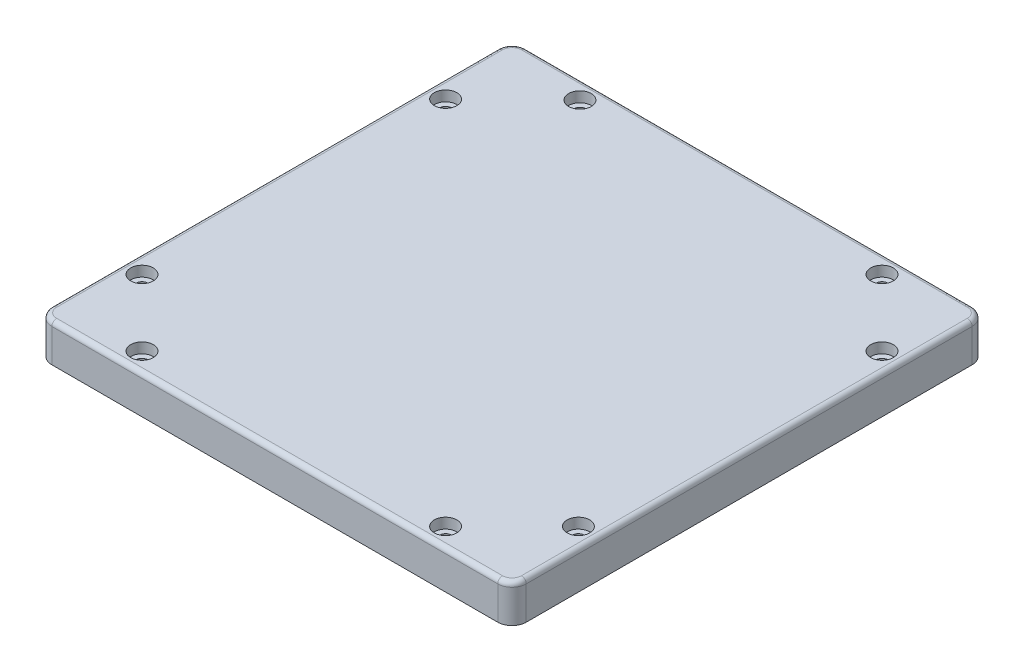
ISO-10303-21;
HEADER;
FILE_DESCRIPTION(('STEP AP214'),'2;1');
FILE_NAME('part.step','',(''),(''),'','','');
FILE_SCHEMA(('AUTOMOTIVE_DESIGN { 1 0 10303 214 1 1 1 1 }'));
ENDSEC;
DATA;
#1=APPLICATION_CONTEXT('core data for automotive mechanical design processes');
#2=APPLICATION_PROTOCOL_DEFINITION('international standard','automotive_design',2000,#1);
#3=PRODUCT_CONTEXT('',#1,'mechanical');
#4=PRODUCT('Part','Part','',(#3));
#5=PRODUCT_RELATED_PRODUCT_CATEGORY('part','',(#4));
#6=PRODUCT_DEFINITION_FORMATION('','',#4);
#7=PRODUCT_DEFINITION_CONTEXT('part definition',#1,'design');
#8=PRODUCT_DEFINITION('design','',#6,#7);
#9=PRODUCT_DEFINITION_SHAPE('','',#8);
#10=(LENGTH_UNIT() NAMED_UNIT(*) SI_UNIT(.MILLI.,.METRE.));
#11=(NAMED_UNIT(*) PLANE_ANGLE_UNIT() SI_UNIT($,.RADIAN.));
#12=(NAMED_UNIT(*) SI_UNIT($,.STERADIAN.) SOLID_ANGLE_UNIT());
#13=UNCERTAINTY_MEASURE_WITH_UNIT(LENGTH_MEASURE(1.E-05),#10,'distance_accuracy_value','');
#14=(GEOMETRIC_REPRESENTATION_CONTEXT(3) GLOBAL_UNCERTAINTY_ASSIGNED_CONTEXT((#13)) GLOBAL_UNIT_ASSIGNED_CONTEXT((#10,
#11,#12)) REPRESENTATION_CONTEXT('',''));
#15=CARTESIAN_POINT('',(0.,0.,0.));
#16=DIRECTION('',(0.,0.,1.));
#17=DIRECTION('',(1.,0.,0.));
#18=AXIS2_PLACEMENT_3D('',#15,#16,#17);
#19=CARTESIAN_POINT('',(0.,8.,0.));
#20=DIRECTION('',(0.,1.,0.));
#21=DIRECTION('',(0.,0.,1.));
#22=AXIS2_PLACEMENT_3D('',#19,#20,#21);
#23=PLANE('',#22);
#24=CARTESIAN_POINT('',(-46.,8.,32.));
#25=DIRECTION('',(0.,1.,0.));
#26=DIRECTION('',(0.,0.,1.));
#27=AXIS2_PLACEMENT_3D('',#24,#25,#26);
#28=CIRCLE('',#27,2.38125);
#29=CARTESIAN_POINT('',(-46.,8.,34.38125));
#30=VERTEX_POINT('',#29);
#31=EDGE_CURVE('E166',#30,#30,#28,.T.);
#32=ORIENTED_EDGE('',*,*,#31,.F.);
#33=EDGE_LOOP('',(#32));
#34=FACE_BOUND('',#33,.T.);
#35=CARTESIAN_POINT('',(-32.,8.,46.));
#36=DIRECTION('',(0.,1.,0.));
#37=DIRECTION('',(0.,0.,1.));
#38=AXIS2_PLACEMENT_3D('',#35,#36,#37);
#39=CIRCLE('',#38,2.38125);
#40=CARTESIAN_POINT('',(-32.,8.,48.38125));
#41=VERTEX_POINT('',#40);
#42=EDGE_CURVE('E276',#41,#41,#39,.T.);
#43=ORIENTED_EDGE('',*,*,#42,.F.);
#44=EDGE_LOOP('',(#43));
#45=FACE_BOUND('',#44,.T.);
#46=CARTESIAN_POINT('',(-46.,8.,-32.));
#47=DIRECTION('',(0.,1.,0.));
#48=DIRECTION('',(0.,0.,1.));
#49=AXIS2_PLACEMENT_3D('',#46,#47,#48);
#50=CIRCLE('',#49,2.38125);
#51=CARTESIAN_POINT('',(-46.,8.,-29.61875));
#52=VERTEX_POINT('',#51);
#53=EDGE_CURVE('E292',#52,#52,#50,.T.);
#54=ORIENTED_EDGE('',*,*,#53,.F.);
#55=EDGE_LOOP('',(#54));
#56=FACE_BOUND('',#55,.T.);
#57=CARTESIAN_POINT('',(-31.6798071992544,8.,-46.));
#58=DIRECTION('',(0.,1.,0.));
#59=DIRECTION('',(0.,0.,1.));
#60=AXIS2_PLACEMENT_3D('',#57,#58,#59);
#61=CIRCLE('',#60,2.38125);
#62=CARTESIAN_POINT('',(-31.6798071992544,8.,-43.61875));
#63=VERTEX_POINT('',#62);
#64=EDGE_CURVE('E308',#63,#63,#61,.T.);
#65=ORIENTED_EDGE('',*,*,#64,.F.);
#66=EDGE_LOOP('',(#65));
#67=FACE_BOUND('',#66,.T.);
#68=CARTESIAN_POINT('',(32.,8.,-46.));
#69=DIRECTION('',(0.,1.,0.));
#70=DIRECTION('',(0.,0.,1.));
#71=AXIS2_PLACEMENT_3D('',#68,#69,#70);
#72=CIRCLE('',#71,2.38125);
#73=CARTESIAN_POINT('',(32.,8.,-43.61875));
#74=VERTEX_POINT('',#73);
#75=EDGE_CURVE('E324',#74,#74,#72,.T.);
#76=ORIENTED_EDGE('',*,*,#75,.F.);
#77=EDGE_LOOP('',(#76));
#78=FACE_BOUND('',#77,.T.);
#79=CARTESIAN_POINT('',(46.,8.,-32.));
#80=DIRECTION('',(0.,1.,0.));
#81=DIRECTION('',(0.,0.,1.));
#82=AXIS2_PLACEMENT_3D('',#79,#80,#81);
#83=CIRCLE('',#82,2.38125);
#84=CARTESIAN_POINT('',(46.,8.,-29.61875));
#85=VERTEX_POINT('',#84);
#86=EDGE_CURVE('E340',#85,#85,#83,.T.);
#87=ORIENTED_EDGE('',*,*,#86,.F.);
#88=EDGE_LOOP('',(#87));
#89=FACE_BOUND('',#88,.T.);
#90=CARTESIAN_POINT('',(32.,8.,46.));
#91=DIRECTION('',(0.,1.,0.));
#92=DIRECTION('',(0.,0.,1.));
#93=AXIS2_PLACEMENT_3D('',#90,#91,#92);
#94=CIRCLE('',#93,2.38125);
#95=CARTESIAN_POINT('',(32.,8.,48.38125));
#96=VERTEX_POINT('',#95);
#97=EDGE_CURVE('E356',#96,#96,#94,.T.);
#98=ORIENTED_EDGE('',*,*,#97,.F.);
#99=EDGE_LOOP('',(#98));
#100=FACE_BOUND('',#99,.T.);
#101=CARTESIAN_POINT('',(46.,8.,32.));
#102=DIRECTION('',(0.,1.,0.));
#103=DIRECTION('',(0.,0.,1.));
#104=AXIS2_PLACEMENT_3D('',#101,#102,#103);
#105=CIRCLE('',#104,2.38125);
#106=CARTESIAN_POINT('',(46.,8.,34.38125));
#107=VERTEX_POINT('',#106);
#108=EDGE_CURVE('E372',#107,#107,#105,.T.);
#109=ORIENTED_EDGE('',*,*,#108,.F.);
#110=EDGE_LOOP('',(#109));
#111=FACE_BOUND('',#110,.T.);
#112=CARTESIAN_POINT('',(47.,8.,47.));
#113=DIRECTION('',(0.,1.,0.));
#114=DIRECTION('',(0.,0.,1.));
#115=AXIS2_PLACEMENT_3D('',#112,#113,#114);
#116=CIRCLE('',#115,2.);
#117=CARTESIAN_POINT('',(49.,8.,47.));
#118=VERTEX_POINT('',#117);
#119=CARTESIAN_POINT('',(47.,8.,49.));
#120=VERTEX_POINT('',#119);
#121=EDGE_CURVE('E222',#118,#120,#116,.F.);
#122=ORIENTED_EDGE('',*,*,#121,.F.);
#123=DIRECTION('',(0.,0.,-1.));
#124=VECTOR('',#123,1.);
#125=CARTESIAN_POINT('',(49.,8.,-50.));
#126=LINE('',#125,#124);
#127=CARTESIAN_POINT('',(49.,8.,-47.));
#128=VERTEX_POINT('',#127);
#129=EDGE_CURVE('E248',#118,#128,#126,.T.);
#130=ORIENTED_EDGE('',*,*,#129,.T.);
#131=CARTESIAN_POINT('',(47.,8.,-47.));
#132=DIRECTION('',(0.,1.,0.));
#133=DIRECTION('',(0.,0.,1.));
#134=AXIS2_PLACEMENT_3D('',#131,#132,#133);
#135=CIRCLE('',#134,2.);
#136=CARTESIAN_POINT('',(47.,8.,-49.));
#137=VERTEX_POINT('',#136);
#138=EDGE_CURVE('E172',#137,#128,#135,.F.);
#139=ORIENTED_EDGE('',*,*,#138,.F.);
#140=DIRECTION('',(-1.,0.,0.));
#141=VECTOR('',#140,1.);
#142=CARTESIAN_POINT('',(-50.,8.,-49.));
#143=LINE('',#142,#141);
#144=CARTESIAN_POINT('',(-47.,8.,-49.));
#145=VERTEX_POINT('',#144);
#146=EDGE_CURVE('E402',#137,#145,#143,.T.);
#147=ORIENTED_EDGE('',*,*,#146,.T.);
#148=CARTESIAN_POINT('',(-47.,8.,-47.));
#149=DIRECTION('',(0.,1.,0.));
#150=DIRECTION('',(0.,0.,1.));
#151=AXIS2_PLACEMENT_3D('',#148,#149,#150);
#152=CIRCLE('',#151,2.);
#153=CARTESIAN_POINT('',(-49.,8.,-47.));
#154=VERTEX_POINT('',#153);
#155=EDGE_CURVE('E170',#154,#145,#152,.F.);
#156=ORIENTED_EDGE('',*,*,#155,.F.);
#157=DIRECTION('',(0.,0.,1.));
#158=VECTOR('',#157,1.);
#159=CARTESIAN_POINT('',(-49.,8.,50.));
#160=LINE('',#159,#158);
#161=CARTESIAN_POINT('',(-49.,8.,47.));
#162=VERTEX_POINT('',#161);
#163=EDGE_CURVE('E405',#154,#162,#160,.T.);
#164=ORIENTED_EDGE('',*,*,#163,.T.);
#165=CARTESIAN_POINT('',(-47.,8.,47.));
#166=DIRECTION('',(0.,1.,0.));
#167=DIRECTION('',(0.,0.,1.));
#168=AXIS2_PLACEMENT_3D('',#165,#166,#167);
#169=CIRCLE('',#168,2.);
#170=CARTESIAN_POINT('',(-47.,8.,49.));
#171=VERTEX_POINT('',#170);
#172=EDGE_CURVE('E177',#171,#162,#169,.F.);
#173=ORIENTED_EDGE('',*,*,#172,.F.);
#174=DIRECTION('',(1.,0.,0.));
#175=VECTOR('',#174,1.);
#176=CARTESIAN_POINT('',(50.,8.,49.));
#177=LINE('',#176,#175);
#178=EDGE_CURVE('E409',#171,#120,#177,.T.);
#179=ORIENTED_EDGE('',*,*,#178,.T.);
#180=EDGE_LOOP('',(#122,#130,#139,#147,#156,#164,#173,#179));
#181=FACE_BOUND('',#180,.T.);
#182=ADVANCED_FACE('F40',(#34,#45,#56,#67,#78,#89,#100,#111,#181),#23,.T.);
#183=CARTESIAN_POINT('',(50.,8.,-50.));
#184=DIRECTION('',(-1.,0.,0.));
#185=DIRECTION('',(0.,0.,1.));
#186=AXIS2_PLACEMENT_3D('',#183,#184,#185);
#187=PLANE('',#186);
#188=DIRECTION('',(0.,0.,-1.));
#189=VECTOR('',#188,1.);
#190=CARTESIAN_POINT('',(50.,7.,50.));
#191=LINE('',#190,#189);
#192=CARTESIAN_POINT('',(50.,7.,-47.));
#193=VERTEX_POINT('',#192);
#194=CARTESIAN_POINT('',(50.,7.,47.));
#195=VERTEX_POINT('',#194);
#196=EDGE_CURVE('E155',#193,#195,#191,.F.);
#197=ORIENTED_EDGE('',*,*,#196,.T.);
#198=DIRECTION('',(0.,-1.,0.));
#199=VECTOR('',#198,1.);
#200=CARTESIAN_POINT('',(50.,8.,47.));
#201=LINE('',#200,#199);
#202=CARTESIAN_POINT('',(50.,0.,47.));
#203=VERTEX_POINT('',#202);
#204=EDGE_CURVE('E64',#195,#203,#201,.T.);
#205=ORIENTED_EDGE('',*,*,#204,.T.);
#206=DIRECTION('',(0.,0.,-1.));
#207=VECTOR('',#206,1.);
#208=CARTESIAN_POINT('',(50.,0.,-50.));
#209=LINE('',#208,#207);
#210=CARTESIAN_POINT('',(50.,0.,-47.));
#211=VERTEX_POINT('',#210);
#212=EDGE_CURVE('E388',#203,#211,#209,.T.);
#213=ORIENTED_EDGE('',*,*,#212,.T.);
#214=DIRECTION('',(0.,-1.,0.));
#215=VECTOR('',#214,1.);
#216=CARTESIAN_POINT('',(50.,8.,-47.));
#217=LINE('',#216,#215);
#218=EDGE_CURVE('E212',#211,#193,#217,.F.);
#219=ORIENTED_EDGE('',*,*,#218,.T.);
#220=EDGE_LOOP('',(#197,#205,#213,#219));
#221=FACE_BOUND('',#220,.T.);
#222=ADVANCED_FACE('F252',(#221),#187,.F.);
#223=CARTESIAN_POINT('',(-50.,8.,-50.));
#224=DIRECTION('',(0.,0.,1.));
#225=DIRECTION('',(1.,0.,0.));
#226=AXIS2_PLACEMENT_3D('',#223,#224,#225);
#227=PLANE('',#226);
#228=DIRECTION('',(-1.,0.,0.));
#229=VECTOR('',#228,1.);
#230=CARTESIAN_POINT('',(50.,7.,-50.));
#231=LINE('',#230,#229);
#232=CARTESIAN_POINT('',(-47.,7.,-50.));
#233=VERTEX_POINT('',#232);
#234=CARTESIAN_POINT('',(47.,7.,-50.));
#235=VERTEX_POINT('',#234);
#236=EDGE_CURVE('E135',#233,#235,#231,.F.);
#237=ORIENTED_EDGE('',*,*,#236,.T.);
#238=DIRECTION('',(0.,-1.,0.));
#239=VECTOR('',#238,1.);
#240=CARTESIAN_POINT('',(47.,8.,-50.));
#241=LINE('',#240,#239);
#242=CARTESIAN_POINT('',(47.,0.,-50.));
#243=VERTEX_POINT('',#242);
#244=EDGE_CURVE('E143',#235,#243,#241,.T.);
#245=ORIENTED_EDGE('',*,*,#244,.T.);
#246=DIRECTION('',(-1.,0.,0.));
#247=VECTOR('',#246,1.);
#248=CARTESIAN_POINT('',(-50.,0.,-50.));
#249=LINE('',#248,#247);
#250=CARTESIAN_POINT('',(-47.,0.,-50.));
#251=VERTEX_POINT('',#250);
#252=EDGE_CURVE('E138',#243,#251,#249,.T.);
#253=ORIENTED_EDGE('',*,*,#252,.T.);
#254=DIRECTION('',(0.,-1.,0.));
#255=VECTOR('',#254,1.);
#256=CARTESIAN_POINT('',(-47.,8.,-50.));
#257=LINE('',#256,#255);
#258=EDGE_CURVE('E132',#251,#233,#257,.F.);
#259=ORIENTED_EDGE('',*,*,#258,.T.);
#260=EDGE_LOOP('',(#237,#245,#253,#259));
#261=FACE_BOUND('',#260,.T.);
#262=ADVANCED_FACE('F134',(#261),#227,.F.);
#263=CARTESIAN_POINT('',(-50.,8.,-50.));
#264=DIRECTION('',(1.,0.,0.));
#265=DIRECTION('',(0.,0.,-1.));
#266=AXIS2_PLACEMENT_3D('',#263,#264,#265);
#267=PLANE('',#266);
#268=DIRECTION('',(0.,0.,1.));
#269=VECTOR('',#268,1.);
#270=CARTESIAN_POINT('',(-50.,0.,-50.));
#271=LINE('',#270,#269);
#272=CARTESIAN_POINT('',(-50.,0.,-47.));
#273=VERTEX_POINT('',#272);
#274=CARTESIAN_POINT('',(-50.,0.,47.));
#275=VERTEX_POINT('',#274);
#276=EDGE_CURVE('E393',#273,#275,#271,.T.);
#277=ORIENTED_EDGE('',*,*,#276,.T.);
#278=DIRECTION('',(0.,-1.,0.));
#279=VECTOR('',#278,1.);
#280=CARTESIAN_POINT('',(-50.,8.,47.));
#281=LINE('',#280,#279);
#282=CARTESIAN_POINT('',(-50.,7.,47.));
#283=VERTEX_POINT('',#282);
#284=EDGE_CURVE('E220',#275,#283,#281,.F.);
#285=ORIENTED_EDGE('',*,*,#284,.T.);
#286=DIRECTION('',(0.,0.,1.));
#287=VECTOR('',#286,1.);
#288=CARTESIAN_POINT('',(-50.,7.,-50.));
#289=LINE('',#288,#287);
#290=CARTESIAN_POINT('',(-50.,7.,-47.));
#291=VERTEX_POINT('',#290);
#292=EDGE_CURVE('E156',#283,#291,#289,.F.);
#293=ORIENTED_EDGE('',*,*,#292,.T.);
#294=DIRECTION('',(0.,-1.,0.));
#295=VECTOR('',#294,1.);
#296=CARTESIAN_POINT('',(-50.,8.,-47.));
#297=LINE('',#296,#295);
#298=EDGE_CURVE('E162',#291,#273,#297,.T.);
#299=ORIENTED_EDGE('',*,*,#298,.T.);
#300=EDGE_LOOP('',(#277,#285,#293,#299));
#301=FACE_BOUND('',#300,.T.);
#302=ADVANCED_FACE('F421',(#301),#267,.F.);
#303=CARTESIAN_POINT('',(-50.,8.,50.));
#304=DIRECTION('',(0.,0.,-1.));
#305=DIRECTION('',(-1.,0.,0.));
#306=AXIS2_PLACEMENT_3D('',#303,#304,#305);
#307=PLANE('',#306);
#308=DIRECTION('',(1.,0.,0.));
#309=VECTOR('',#308,1.);
#310=CARTESIAN_POINT('',(-50.,0.,50.));
#311=LINE('',#310,#309);
#312=CARTESIAN_POINT('',(-47.,0.,50.));
#313=VERTEX_POINT('',#312);
#314=CARTESIAN_POINT('',(47.,0.,50.));
#315=VERTEX_POINT('',#314);
#316=EDGE_CURVE('E397',#313,#315,#311,.T.);
#317=ORIENTED_EDGE('',*,*,#316,.T.);
#318=DIRECTION('',(0.,-1.,0.));
#319=VECTOR('',#318,1.);
#320=CARTESIAN_POINT('',(47.,8.,50.));
#321=LINE('',#320,#319);
#322=CARTESIAN_POINT('',(47.,7.,50.));
#323=VERTEX_POINT('',#322);
#324=EDGE_CURVE('E11',#315,#323,#321,.F.);
#325=ORIENTED_EDGE('',*,*,#324,.T.);
#326=DIRECTION('',(1.,0.,0.));
#327=VECTOR('',#326,1.);
#328=CARTESIAN_POINT('',(-50.,7.,50.));
#329=LINE('',#328,#327);
#330=CARTESIAN_POINT('',(-47.,7.,50.));
#331=VERTEX_POINT('',#330);
#332=EDGE_CURVE('E413',#323,#331,#329,.F.);
#333=ORIENTED_EDGE('',*,*,#332,.T.);
#334=DIRECTION('',(0.,-1.,0.));
#335=VECTOR('',#334,1.);
#336=CARTESIAN_POINT('',(-47.,8.,50.));
#337=LINE('',#336,#335);
#338=EDGE_CURVE('E215',#331,#313,#337,.T.);
#339=ORIENTED_EDGE('',*,*,#338,.T.);
#340=EDGE_LOOP('',(#317,#325,#333,#339));
#341=FACE_BOUND('',#340,.T.);
#342=ADVANCED_FACE('F442',(#341),#307,.F.);
#343=CARTESIAN_POINT('',(0.,0.,0.));
#344=DIRECTION('',(0.,1.,0.));
#345=DIRECTION('',(0.,0.,1.));
#346=AXIS2_PLACEMENT_3D('',#343,#344,#345);
#347=PLANE('',#346);
#348=CARTESIAN_POINT('',(-46.,0.,32.));
#349=DIRECTION('',(0.,1.,0.));
#350=DIRECTION('',(0.,0.,1.));
#351=AXIS2_PLACEMENT_3D('',#348,#349,#350);
#352=CIRCLE('',#351,1.2192);
#353=CARTESIAN_POINT('',(-46.,0.,33.2192));
#354=VERTEX_POINT('',#353);
#355=EDGE_CURVE('E272',#354,#354,#352,.T.);
#356=ORIENTED_EDGE('',*,*,#355,.T.);
#357=EDGE_LOOP('',(#356));
#358=FACE_BOUND('',#357,.T.);
#359=CARTESIAN_POINT('',(-32.,0.,46.));
#360=DIRECTION('',(0.,1.,0.));
#361=DIRECTION('',(0.,0.,1.));
#362=AXIS2_PLACEMENT_3D('',#359,#360,#361);
#363=CIRCLE('',#362,1.2192);
#364=CARTESIAN_POINT('',(-32.,0.,47.2192));
#365=VERTEX_POINT('',#364);
#366=EDGE_CURVE('E288',#365,#365,#363,.T.);
#367=ORIENTED_EDGE('',*,*,#366,.T.);
#368=EDGE_LOOP('',(#367));
#369=FACE_BOUND('',#368,.T.);
#370=CARTESIAN_POINT('',(-46.,0.,-32.));
#371=DIRECTION('',(0.,1.,0.));
#372=DIRECTION('',(0.,0.,1.));
#373=AXIS2_PLACEMENT_3D('',#370,#371,#372);
#374=CIRCLE('',#373,1.2192);
#375=CARTESIAN_POINT('',(-46.,0.,-30.7808));
#376=VERTEX_POINT('',#375);
#377=EDGE_CURVE('E304',#376,#376,#374,.T.);
#378=ORIENTED_EDGE('',*,*,#377,.T.);
#379=EDGE_LOOP('',(#378));
#380=FACE_BOUND('',#379,.T.);
#381=CARTESIAN_POINT('',(-31.6798071992544,0.,-46.));
#382=DIRECTION('',(0.,1.,0.));
#383=DIRECTION('',(0.,0.,1.));
#384=AXIS2_PLACEMENT_3D('',#381,#382,#383);
#385=CIRCLE('',#384,1.2192);
#386=CARTESIAN_POINT('',(-31.6798071992544,0.,-44.7808));
#387=VERTEX_POINT('',#386);
#388=EDGE_CURVE('E320',#387,#387,#385,.T.);
#389=ORIENTED_EDGE('',*,*,#388,.T.);
#390=EDGE_LOOP('',(#389));
#391=FACE_BOUND('',#390,.T.);
#392=CARTESIAN_POINT('',(32.,0.,-46.));
#393=DIRECTION('',(0.,1.,0.));
#394=DIRECTION('',(0.,0.,1.));
#395=AXIS2_PLACEMENT_3D('',#392,#393,#394);
#396=CIRCLE('',#395,1.2192);
#397=CARTESIAN_POINT('',(32.,0.,-44.7808));
#398=VERTEX_POINT('',#397);
#399=EDGE_CURVE('E336',#398,#398,#396,.T.);
#400=ORIENTED_EDGE('',*,*,#399,.T.);
#401=EDGE_LOOP('',(#400));
#402=FACE_BOUND('',#401,.T.);
#403=CARTESIAN_POINT('',(46.,0.,-32.));
#404=DIRECTION('',(0.,1.,0.));
#405=DIRECTION('',(0.,0.,1.));
#406=AXIS2_PLACEMENT_3D('',#403,#404,#405);
#407=CIRCLE('',#406,1.2192);
#408=CARTESIAN_POINT('',(46.,0.,-30.7808));
#409=VERTEX_POINT('',#408);
#410=EDGE_CURVE('E352',#409,#409,#407,.T.);
#411=ORIENTED_EDGE('',*,*,#410,.T.);
#412=EDGE_LOOP('',(#411));
#413=FACE_BOUND('',#412,.T.);
#414=CARTESIAN_POINT('',(32.,0.,46.));
#415=DIRECTION('',(0.,1.,0.));
#416=DIRECTION('',(0.,0.,1.));
#417=AXIS2_PLACEMENT_3D('',#414,#415,#416);
#418=CIRCLE('',#417,1.2192);
#419=CARTESIAN_POINT('',(32.,0.,47.2192));
#420=VERTEX_POINT('',#419);
#421=EDGE_CURVE('E368',#420,#420,#418,.T.);
#422=ORIENTED_EDGE('',*,*,#421,.T.);
#423=EDGE_LOOP('',(#422));
#424=FACE_BOUND('',#423,.T.);
#425=CARTESIAN_POINT('',(46.,0.,32.));
#426=DIRECTION('',(0.,1.,0.));
#427=DIRECTION('',(0.,0.,1.));
#428=AXIS2_PLACEMENT_3D('',#425,#426,#427);
#429=CIRCLE('',#428,1.2192);
#430=CARTESIAN_POINT('',(46.,0.,33.2192));
#431=VERTEX_POINT('',#430);
#432=EDGE_CURVE('E384',#431,#431,#429,.T.);
#433=ORIENTED_EDGE('',*,*,#432,.T.);
#434=EDGE_LOOP('',(#433));
#435=FACE_BOUND('',#434,.T.);
#436=ORIENTED_EDGE('',*,*,#212,.F.);
#437=CARTESIAN_POINT('',(47.,0.,47.));
#438=DIRECTION('',(0.,1.,0.));
#439=DIRECTION('',(0.,0.,1.));
#440=AXIS2_PLACEMENT_3D('',#437,#438,#439);
#441=CIRCLE('',#440,3.);
#442=EDGE_CURVE('E50',#203,#315,#441,.F.);
#443=ORIENTED_EDGE('',*,*,#442,.T.);
#444=ORIENTED_EDGE('',*,*,#316,.F.);
#445=CARTESIAN_POINT('',(-47.,0.,47.));
#446=DIRECTION('',(0.,1.,0.));
#447=DIRECTION('',(0.,0.,1.));
#448=AXIS2_PLACEMENT_3D('',#445,#446,#447);
#449=CIRCLE('',#448,3.);
#450=EDGE_CURVE('E205',#313,#275,#449,.F.);
#451=ORIENTED_EDGE('',*,*,#450,.T.);
#452=ORIENTED_EDGE('',*,*,#276,.F.);
#453=CARTESIAN_POINT('',(-47.,0.,-47.));
#454=DIRECTION('',(0.,1.,0.));
#455=DIRECTION('',(0.,0.,1.));
#456=AXIS2_PLACEMENT_3D('',#453,#454,#455);
#457=CIRCLE('',#456,3.);
#458=EDGE_CURVE('E202',#273,#251,#457,.F.);
#459=ORIENTED_EDGE('',*,*,#458,.T.);
#460=ORIENTED_EDGE('',*,*,#252,.F.);
#461=CARTESIAN_POINT('',(47.,0.,-47.));
#462=DIRECTION('',(0.,1.,0.));
#463=DIRECTION('',(0.,0.,1.));
#464=AXIS2_PLACEMENT_3D('',#461,#462,#463);
#465=CIRCLE('',#464,3.);
#466=EDGE_CURVE('E208',#243,#211,#465,.F.);
#467=ORIENTED_EDGE('',*,*,#466,.T.);
#468=EDGE_LOOP('',(#436,#443,#444,#451,#452,#459,#460,#467));
#469=FACE_BOUND('',#468,.T.);
#470=ADVANCED_FACE('F443',(#358,#369,#380,#391,#402,#413,#424,#435,#469),#347,.F.);
#471=CARTESIAN_POINT('',(46.,8.,32.));
#472=DIRECTION('',(0.,1.,0.));
#473=DIRECTION('',(0.,0.,1.));
#474=AXIS2_PLACEMENT_3D('',#471,#472,#473);
#475=CYLINDRICAL_SURFACE('',#474,1.2192);
#476=ORIENTED_EDGE('',*,*,#432,.F.);
#477=EDGE_LOOP('',(#476));
#478=FACE_BOUND('',#477,.T.);
#479=CARTESIAN_POINT('',(46.,5.8156,32.));
#480=DIRECTION('',(0.,1.,0.));
#481=DIRECTION('',(0.,0.,1.));
#482=AXIS2_PLACEMENT_3D('',#479,#480,#481);
#483=CIRCLE('',#482,1.2192);
#484=CARTESIAN_POINT('',(46.,5.8156,33.2192));
#485=VERTEX_POINT('',#484);
#486=EDGE_CURVE('E380',#485,#485,#483,.T.);
#487=ORIENTED_EDGE('',*,*,#486,.T.);
#488=EDGE_LOOP('',(#487));
#489=FACE_BOUND('',#488,.T.);
#490=ADVANCED_FACE('F470',(#478,#489),#475,.F.);
#491=CARTESIAN_POINT('',(47.2192,5.8156,32.));
#492=DIRECTION('',(0.,-1.,0.));
#493=DIRECTION('',(0.,0.,-1.));
#494=AXIS2_PLACEMENT_3D('',#491,#492,#493);
#495=PLANE('',#494);
#496=ORIENTED_EDGE('',*,*,#486,.F.);
#497=EDGE_LOOP('',(#496));
#498=FACE_BOUND('',#497,.T.);
#499=CARTESIAN_POINT('',(46.,5.8156,32.));
#500=DIRECTION('',(0.,1.,0.));
#501=DIRECTION('',(0.,0.,1.));
#502=AXIS2_PLACEMENT_3D('',#499,#500,#501);
#503=CIRCLE('',#502,2.38125);
#504=CARTESIAN_POINT('',(46.,5.8156,34.38125));
#505=VERTEX_POINT('',#504);
#506=EDGE_CURVE('E376',#505,#505,#503,.T.);
#507=ORIENTED_EDGE('',*,*,#506,.T.);
#508=EDGE_LOOP('',(#507));
#509=FACE_BOUND('',#508,.T.);
#510=ADVANCED_FACE('F826',(#498,#509),#495,.F.);
#511=CARTESIAN_POINT('',(46.,8.,32.));
#512=DIRECTION('',(0.,1.,0.));
#513=DIRECTION('',(0.,0.,1.));
#514=AXIS2_PLACEMENT_3D('',#511,#512,#513);
#515=CYLINDRICAL_SURFACE('',#514,2.38125);
#516=ORIENTED_EDGE('',*,*,#506,.F.);
#517=EDGE_LOOP('',(#516));
#518=FACE_BOUND('',#517,.T.);
#519=ORIENTED_EDGE('',*,*,#108,.T.);
#520=EDGE_LOOP('',(#519));
#521=FACE_BOUND('',#520,.T.);
#522=ADVANCED_FACE('F816',(#518,#521),#515,.F.);
#523=CARTESIAN_POINT('',(32.,8.,46.));
#524=DIRECTION('',(0.,1.,0.));
#525=DIRECTION('',(0.,0.,1.));
#526=AXIS2_PLACEMENT_3D('',#523,#524,#525);
#527=CYLINDRICAL_SURFACE('',#526,1.2192);
#528=ORIENTED_EDGE('',*,*,#421,.F.);
#529=EDGE_LOOP('',(#528));
#530=FACE_BOUND('',#529,.T.);
#531=CARTESIAN_POINT('',(32.,5.8156,46.));
#532=DIRECTION('',(0.,1.,0.));
#533=DIRECTION('',(0.,0.,1.));
#534=AXIS2_PLACEMENT_3D('',#531,#532,#533);
#535=CIRCLE('',#534,1.2192);
#536=CARTESIAN_POINT('',(32.,5.8156,47.2192));
#537=VERTEX_POINT('',#536);
#538=EDGE_CURVE('E364',#537,#537,#535,.T.);
#539=ORIENTED_EDGE('',*,*,#538,.T.);
#540=EDGE_LOOP('',(#539));
#541=FACE_BOUND('',#540,.T.);
#542=ADVANCED_FACE('F806',(#530,#541),#527,.F.);
#543=CARTESIAN_POINT('',(33.2192,5.8156,46.));
#544=DIRECTION('',(0.,-1.,0.));
#545=DIRECTION('',(0.,0.,-1.));
#546=AXIS2_PLACEMENT_3D('',#543,#544,#545);
#547=PLANE('',#546);
#548=ORIENTED_EDGE('',*,*,#538,.F.);
#549=EDGE_LOOP('',(#548));
#550=FACE_BOUND('',#549,.T.);
#551=CARTESIAN_POINT('',(32.,5.8156,46.));
#552=DIRECTION('',(0.,1.,0.));
#553=DIRECTION('',(0.,0.,1.));
#554=AXIS2_PLACEMENT_3D('',#551,#552,#553);
#555=CIRCLE('',#554,2.38125);
#556=CARTESIAN_POINT('',(32.,5.8156,48.38125));
#557=VERTEX_POINT('',#556);
#558=EDGE_CURVE('E360',#557,#557,#555,.T.);
#559=ORIENTED_EDGE('',*,*,#558,.T.);
#560=EDGE_LOOP('',(#559));
#561=FACE_BOUND('',#560,.T.);
#562=ADVANCED_FACE('F796',(#550,#561),#547,.F.);
#563=CARTESIAN_POINT('',(32.,8.,46.));
#564=DIRECTION('',(0.,1.,0.));
#565=DIRECTION('',(0.,0.,1.));
#566=AXIS2_PLACEMENT_3D('',#563,#564,#565);
#567=CYLINDRICAL_SURFACE('',#566,2.38125);
#568=ORIENTED_EDGE('',*,*,#558,.F.);
#569=EDGE_LOOP('',(#568));
#570=FACE_BOUND('',#569,.T.);
#571=ORIENTED_EDGE('',*,*,#97,.T.);
#572=EDGE_LOOP('',(#571));
#573=FACE_BOUND('',#572,.T.);
#574=ADVANCED_FACE('F786',(#570,#573),#567,.F.);
#575=CARTESIAN_POINT('',(46.,8.,-32.));
#576=DIRECTION('',(0.,1.,0.));
#577=DIRECTION('',(0.,0.,1.));
#578=AXIS2_PLACEMENT_3D('',#575,#576,#577);
#579=CYLINDRICAL_SURFACE('',#578,1.2192);
#580=ORIENTED_EDGE('',*,*,#410,.F.);
#581=EDGE_LOOP('',(#580));
#582=FACE_BOUND('',#581,.T.);
#583=CARTESIAN_POINT('',(46.,5.8156,-32.));
#584=DIRECTION('',(0.,1.,0.));
#585=DIRECTION('',(0.,0.,1.));
#586=AXIS2_PLACEMENT_3D('',#583,#584,#585);
#587=CIRCLE('',#586,1.2192);
#588=CARTESIAN_POINT('',(46.,5.8156,-30.7808));
#589=VERTEX_POINT('',#588);
#590=EDGE_CURVE('E348',#589,#589,#587,.T.);
#591=ORIENTED_EDGE('',*,*,#590,.T.);
#592=EDGE_LOOP('',(#591));
#593=FACE_BOUND('',#592,.T.);
#594=ADVANCED_FACE('F776',(#582,#593),#579,.F.);
#595=CARTESIAN_POINT('',(47.2192,5.8156,-32.));
#596=DIRECTION('',(0.,-1.,0.));
#597=DIRECTION('',(0.,0.,-1.));
#598=AXIS2_PLACEMENT_3D('',#595,#596,#597);
#599=PLANE('',#598);
#600=ORIENTED_EDGE('',*,*,#590,.F.);
#601=EDGE_LOOP('',(#600));
#602=FACE_BOUND('',#601,.T.);
#603=CARTESIAN_POINT('',(46.,5.8156,-32.));
#604=DIRECTION('',(0.,1.,0.));
#605=DIRECTION('',(0.,0.,1.));
#606=AXIS2_PLACEMENT_3D('',#603,#604,#605);
#607=CIRCLE('',#606,2.38125);
#608=CARTESIAN_POINT('',(46.,5.8156,-29.61875));
#609=VERTEX_POINT('',#608);
#610=EDGE_CURVE('E344',#609,#609,#607,.T.);
#611=ORIENTED_EDGE('',*,*,#610,.T.);
#612=EDGE_LOOP('',(#611));
#613=FACE_BOUND('',#612,.T.);
#614=ADVANCED_FACE('F766',(#602,#613),#599,.F.);
#615=CARTESIAN_POINT('',(46.,8.,-32.));
#616=DIRECTION('',(0.,1.,0.));
#617=DIRECTION('',(0.,0.,1.));
#618=AXIS2_PLACEMENT_3D('',#615,#616,#617);
#619=CYLINDRICAL_SURFACE('',#618,2.38125);
#620=ORIENTED_EDGE('',*,*,#610,.F.);
#621=EDGE_LOOP('',(#620));
#622=FACE_BOUND('',#621,.T.);
#623=ORIENTED_EDGE('',*,*,#86,.T.);
#624=EDGE_LOOP('',(#623));
#625=FACE_BOUND('',#624,.T.);
#626=ADVANCED_FACE('F756',(#622,#625),#619,.F.);
#627=CARTESIAN_POINT('',(32.,8.,-46.));
#628=DIRECTION('',(0.,1.,0.));
#629=DIRECTION('',(0.,0.,1.));
#630=AXIS2_PLACEMENT_3D('',#627,#628,#629);
#631=CYLINDRICAL_SURFACE('',#630,1.2192);
#632=ORIENTED_EDGE('',*,*,#399,.F.);
#633=EDGE_LOOP('',(#632));
#634=FACE_BOUND('',#633,.T.);
#635=CARTESIAN_POINT('',(32.,5.8156,-46.));
#636=DIRECTION('',(0.,1.,0.));
#637=DIRECTION('',(0.,0.,1.));
#638=AXIS2_PLACEMENT_3D('',#635,#636,#637);
#639=CIRCLE('',#638,1.2192);
#640=CARTESIAN_POINT('',(32.,5.8156,-44.7808));
#641=VERTEX_POINT('',#640);
#642=EDGE_CURVE('E332',#641,#641,#639,.T.);
#643=ORIENTED_EDGE('',*,*,#642,.T.);
#644=EDGE_LOOP('',(#643));
#645=FACE_BOUND('',#644,.T.);
#646=ADVANCED_FACE('F746',(#634,#645),#631,.F.);
#647=CARTESIAN_POINT('',(33.2192,5.8156,-46.));
#648=DIRECTION('',(0.,-1.,0.));
#649=DIRECTION('',(0.,0.,-1.));
#650=AXIS2_PLACEMENT_3D('',#647,#648,#649);
#651=PLANE('',#650);
#652=ORIENTED_EDGE('',*,*,#642,.F.);
#653=EDGE_LOOP('',(#652));
#654=FACE_BOUND('',#653,.T.);
#655=CARTESIAN_POINT('',(32.,5.8156,-46.));
#656=DIRECTION('',(0.,1.,0.));
#657=DIRECTION('',(0.,0.,1.));
#658=AXIS2_PLACEMENT_3D('',#655,#656,#657);
#659=CIRCLE('',#658,2.38125);
#660=CARTESIAN_POINT('',(32.,5.8156,-43.61875));
#661=VERTEX_POINT('',#660);
#662=EDGE_CURVE('E328',#661,#661,#659,.T.);
#663=ORIENTED_EDGE('',*,*,#662,.T.);
#664=EDGE_LOOP('',(#663));
#665=FACE_BOUND('',#664,.T.);
#666=ADVANCED_FACE('F736',(#654,#665),#651,.F.);
#667=CARTESIAN_POINT('',(32.,8.,-46.));
#668=DIRECTION('',(0.,1.,0.));
#669=DIRECTION('',(0.,0.,1.));
#670=AXIS2_PLACEMENT_3D('',#667,#668,#669);
#671=CYLINDRICAL_SURFACE('',#670,2.38125);
#672=ORIENTED_EDGE('',*,*,#662,.F.);
#673=EDGE_LOOP('',(#672));
#674=FACE_BOUND('',#673,.T.);
#675=ORIENTED_EDGE('',*,*,#75,.T.);
#676=EDGE_LOOP('',(#675));
#677=FACE_BOUND('',#676,.T.);
#678=ADVANCED_FACE('F726',(#674,#677),#671,.F.);
#679=CARTESIAN_POINT('',(-31.6798071992544,8.,-46.));
#680=DIRECTION('',(0.,1.,0.));
#681=DIRECTION('',(0.,0.,1.));
#682=AXIS2_PLACEMENT_3D('',#679,#680,#681);
#683=CYLINDRICAL_SURFACE('',#682,1.2192);
#684=ORIENTED_EDGE('',*,*,#388,.F.);
#685=EDGE_LOOP('',(#684));
#686=FACE_BOUND('',#685,.T.);
#687=CARTESIAN_POINT('',(-31.6798071992544,5.8156,-46.));
#688=DIRECTION('',(0.,1.,0.));
#689=DIRECTION('',(0.,0.,1.));
#690=AXIS2_PLACEMENT_3D('',#687,#688,#689);
#691=CIRCLE('',#690,1.2192);
#692=CARTESIAN_POINT('',(-31.6798071992544,5.8156,-44.7808));
#693=VERTEX_POINT('',#692);
#694=EDGE_CURVE('E316',#693,#693,#691,.T.);
#695=ORIENTED_EDGE('',*,*,#694,.T.);
#696=EDGE_LOOP('',(#695));
#697=FACE_BOUND('',#696,.T.);
#698=ADVANCED_FACE('F716',(#686,#697),#683,.F.);
#699=CARTESIAN_POINT('',(-30.4606071992544,5.8156,-46.));
#700=DIRECTION('',(0.,-1.,0.));
#701=DIRECTION('',(0.,0.,-1.));
#702=AXIS2_PLACEMENT_3D('',#699,#700,#701);
#703=PLANE('',#702);
#704=ORIENTED_EDGE('',*,*,#694,.F.);
#705=EDGE_LOOP('',(#704));
#706=FACE_BOUND('',#705,.T.);
#707=CARTESIAN_POINT('',(-31.6798071992544,5.8156,-46.));
#708=DIRECTION('',(0.,1.,0.));
#709=DIRECTION('',(0.,0.,1.));
#710=AXIS2_PLACEMENT_3D('',#707,#708,#709);
#711=CIRCLE('',#710,2.38125);
#712=CARTESIAN_POINT('',(-31.6798071992544,5.8156,-43.61875));
#713=VERTEX_POINT('',#712);
#714=EDGE_CURVE('E312',#713,#713,#711,.T.);
#715=ORIENTED_EDGE('',*,*,#714,.T.);
#716=EDGE_LOOP('',(#715));
#717=FACE_BOUND('',#716,.T.);
#718=ADVANCED_FACE('F706',(#706,#717),#703,.F.);
#719=CARTESIAN_POINT('',(-31.6798071992544,8.,-46.));
#720=DIRECTION('',(0.,1.,0.));
#721=DIRECTION('',(0.,0.,1.));
#722=AXIS2_PLACEMENT_3D('',#719,#720,#721);
#723=CYLINDRICAL_SURFACE('',#722,2.38125);
#724=ORIENTED_EDGE('',*,*,#714,.F.);
#725=EDGE_LOOP('',(#724));
#726=FACE_BOUND('',#725,.T.);
#727=ORIENTED_EDGE('',*,*,#64,.T.);
#728=EDGE_LOOP('',(#727));
#729=FACE_BOUND('',#728,.T.);
#730=ADVANCED_FACE('F696',(#726,#729),#723,.F.);
#731=CARTESIAN_POINT('',(-46.,8.,-32.));
#732=DIRECTION('',(0.,1.,0.));
#733=DIRECTION('',(0.,0.,1.));
#734=AXIS2_PLACEMENT_3D('',#731,#732,#733);
#735=CYLINDRICAL_SURFACE('',#734,1.2192);
#736=ORIENTED_EDGE('',*,*,#377,.F.);
#737=EDGE_LOOP('',(#736));
#738=FACE_BOUND('',#737,.T.);
#739=CARTESIAN_POINT('',(-46.,5.8156,-32.));
#740=DIRECTION('',(0.,1.,0.));
#741=DIRECTION('',(0.,0.,1.));
#742=AXIS2_PLACEMENT_3D('',#739,#740,#741);
#743=CIRCLE('',#742,1.2192);
#744=CARTESIAN_POINT('',(-46.,5.8156,-30.7808));
#745=VERTEX_POINT('',#744);
#746=EDGE_CURVE('E300',#745,#745,#743,.T.);
#747=ORIENTED_EDGE('',*,*,#746,.T.);
#748=EDGE_LOOP('',(#747));
#749=FACE_BOUND('',#748,.T.);
#750=ADVANCED_FACE('F686',(#738,#749),#735,.F.);
#751=CARTESIAN_POINT('',(-44.7808,5.8156,-32.));
#752=DIRECTION('',(0.,-1.,0.));
#753=DIRECTION('',(0.,0.,-1.));
#754=AXIS2_PLACEMENT_3D('',#751,#752,#753);
#755=PLANE('',#754);
#756=ORIENTED_EDGE('',*,*,#746,.F.);
#757=EDGE_LOOP('',(#756));
#758=FACE_BOUND('',#757,.T.);
#759=CARTESIAN_POINT('',(-46.,5.8156,-32.));
#760=DIRECTION('',(0.,1.,0.));
#761=DIRECTION('',(0.,0.,1.));
#762=AXIS2_PLACEMENT_3D('',#759,#760,#761);
#763=CIRCLE('',#762,2.38125);
#764=CARTESIAN_POINT('',(-46.,5.8156,-29.61875));
#765=VERTEX_POINT('',#764);
#766=EDGE_CURVE('E296',#765,#765,#763,.T.);
#767=ORIENTED_EDGE('',*,*,#766,.T.);
#768=EDGE_LOOP('',(#767));
#769=FACE_BOUND('',#768,.T.);
#770=ADVANCED_FACE('F676',(#758,#769),#755,.F.);
#771=CARTESIAN_POINT('',(-46.,8.,-32.));
#772=DIRECTION('',(0.,1.,0.));
#773=DIRECTION('',(0.,0.,1.));
#774=AXIS2_PLACEMENT_3D('',#771,#772,#773);
#775=CYLINDRICAL_SURFACE('',#774,2.38125);
#776=ORIENTED_EDGE('',*,*,#766,.F.);
#777=EDGE_LOOP('',(#776));
#778=FACE_BOUND('',#777,.T.);
#779=ORIENTED_EDGE('',*,*,#53,.T.);
#780=EDGE_LOOP('',(#779));
#781=FACE_BOUND('',#780,.T.);
#782=ADVANCED_FACE('F666',(#778,#781),#775,.F.);
#783=CARTESIAN_POINT('',(-32.,8.,46.));
#784=DIRECTION('',(0.,1.,0.));
#785=DIRECTION('',(0.,0.,1.));
#786=AXIS2_PLACEMENT_3D('',#783,#784,#785);
#787=CYLINDRICAL_SURFACE('',#786,1.2192);
#788=ORIENTED_EDGE('',*,*,#366,.F.);
#789=EDGE_LOOP('',(#788));
#790=FACE_BOUND('',#789,.T.);
#791=CARTESIAN_POINT('',(-32.,5.8156,46.));
#792=DIRECTION('',(0.,1.,0.));
#793=DIRECTION('',(0.,0.,1.));
#794=AXIS2_PLACEMENT_3D('',#791,#792,#793);
#795=CIRCLE('',#794,1.2192);
#796=CARTESIAN_POINT('',(-32.,5.8156,47.2192));
#797=VERTEX_POINT('',#796);
#798=EDGE_CURVE('E284',#797,#797,#795,.T.);
#799=ORIENTED_EDGE('',*,*,#798,.T.);
#800=EDGE_LOOP('',(#799));
#801=FACE_BOUND('',#800,.T.);
#802=ADVANCED_FACE('F656',(#790,#801),#787,.F.);
#803=CARTESIAN_POINT('',(-30.7808,5.8156,46.));
#804=DIRECTION('',(0.,-1.,0.));
#805=DIRECTION('',(0.,0.,-1.));
#806=AXIS2_PLACEMENT_3D('',#803,#804,#805);
#807=PLANE('',#806);
#808=ORIENTED_EDGE('',*,*,#798,.F.);
#809=EDGE_LOOP('',(#808));
#810=FACE_BOUND('',#809,.T.);
#811=CARTESIAN_POINT('',(-32.,5.8156,46.));
#812=DIRECTION('',(0.,1.,0.));
#813=DIRECTION('',(0.,0.,1.));
#814=AXIS2_PLACEMENT_3D('',#811,#812,#813);
#815=CIRCLE('',#814,2.38125);
#816=CARTESIAN_POINT('',(-32.,5.8156,48.38125));
#817=VERTEX_POINT('',#816);
#818=EDGE_CURVE('E280',#817,#817,#815,.T.);
#819=ORIENTED_EDGE('',*,*,#818,.T.);
#820=EDGE_LOOP('',(#819));
#821=FACE_BOUND('',#820,.T.);
#822=ADVANCED_FACE('F646',(#810,#821),#807,.F.);
#823=CARTESIAN_POINT('',(-32.,8.,46.));
#824=DIRECTION('',(0.,1.,0.));
#825=DIRECTION('',(0.,0.,1.));
#826=AXIS2_PLACEMENT_3D('',#823,#824,#825);
#827=CYLINDRICAL_SURFACE('',#826,2.38125);
#828=ORIENTED_EDGE('',*,*,#818,.F.);
#829=EDGE_LOOP('',(#828));
#830=FACE_BOUND('',#829,.T.);
#831=ORIENTED_EDGE('',*,*,#42,.T.);
#832=EDGE_LOOP('',(#831));
#833=FACE_BOUND('',#832,.T.);
#834=ADVANCED_FACE('F636',(#830,#833),#827,.F.);
#835=CARTESIAN_POINT('',(-46.,8.,32.));
#836=DIRECTION('',(0.,1.,0.));
#837=DIRECTION('',(0.,0.,1.));
#838=AXIS2_PLACEMENT_3D('',#835,#836,#837);
#839=CYLINDRICAL_SURFACE('',#838,1.2192);
#840=ORIENTED_EDGE('',*,*,#355,.F.);
#841=EDGE_LOOP('',(#840));
#842=FACE_BOUND('',#841,.T.);
#843=CARTESIAN_POINT('',(-46.,5.8156,32.));
#844=DIRECTION('',(0.,1.,0.));
#845=DIRECTION('',(0.,0.,1.));
#846=AXIS2_PLACEMENT_3D('',#843,#844,#845);
#847=CIRCLE('',#846,1.2192);
#848=CARTESIAN_POINT('',(-46.,5.8156,33.2192));
#849=VERTEX_POINT('',#848);
#850=EDGE_CURVE('E268',#849,#849,#847,.T.);
#851=ORIENTED_EDGE('',*,*,#850,.T.);
#852=EDGE_LOOP('',(#851));
#853=FACE_BOUND('',#852,.T.);
#854=ADVANCED_FACE('F626',(#842,#853),#839,.F.);
#855=CARTESIAN_POINT('',(-44.7808,5.8156,32.));
#856=DIRECTION('',(0.,-1.,0.));
#857=DIRECTION('',(0.,0.,-1.));
#858=AXIS2_PLACEMENT_3D('',#855,#856,#857);
#859=PLANE('',#858);
#860=ORIENTED_EDGE('',*,*,#850,.F.);
#861=EDGE_LOOP('',(#860));
#862=FACE_BOUND('',#861,.T.);
#863=CARTESIAN_POINT('',(-46.,5.8156,32.));
#864=DIRECTION('',(0.,1.,0.));
#865=DIRECTION('',(0.,0.,1.));
#866=AXIS2_PLACEMENT_3D('',#863,#864,#865);
#867=CIRCLE('',#866,2.38125);
#868=CARTESIAN_POINT('',(-46.,5.8156,34.38125));
#869=VERTEX_POINT('',#868);
#870=EDGE_CURVE('E264',#869,#869,#867,.T.);
#871=ORIENTED_EDGE('',*,*,#870,.T.);
#872=EDGE_LOOP('',(#871));
#873=FACE_BOUND('',#872,.T.);
#874=ADVANCED_FACE('F616',(#862,#873),#859,.F.);
#875=CARTESIAN_POINT('',(-46.,8.,32.));
#876=DIRECTION('',(0.,1.,0.));
#877=DIRECTION('',(0.,0.,1.));
#878=AXIS2_PLACEMENT_3D('',#875,#876,#877);
#879=CYLINDRICAL_SURFACE('',#878,2.38125);
#880=ORIENTED_EDGE('',*,*,#870,.F.);
#881=EDGE_LOOP('',(#880));
#882=FACE_BOUND('',#881,.T.);
#883=ORIENTED_EDGE('',*,*,#31,.T.);
#884=EDGE_LOOP('',(#883));
#885=FACE_BOUND('',#884,.T.);
#886=ADVANCED_FACE('F489',(#882,#885),#879,.F.);
#887=CARTESIAN_POINT('',(0.,7.,-49.));
#888=DIRECTION('',(1.,0.,0.));
#889=DIRECTION('',(0.,0.,-1.));
#890=AXIS2_PLACEMENT_3D('',#887,#888,#889);
#891=CYLINDRICAL_SURFACE('',#890,1.);
#892=ORIENTED_EDGE('',*,*,#236,.F.);
#893=CARTESIAN_POINT('',(-47.,7.,-49.));
#894=DIRECTION('',(1.,0.,0.));
#895=DIRECTION('',(0.,0.,-1.));
#896=AXIS2_PLACEMENT_3D('',#893,#894,#895);
#897=CIRCLE('',#896,1.);
#898=EDGE_CURVE('E151',#233,#145,#897,.T.);
#899=ORIENTED_EDGE('',*,*,#898,.T.);
#900=ORIENTED_EDGE('',*,*,#146,.F.);
#901=CARTESIAN_POINT('',(47.,7.,-49.));
#902=DIRECTION('',(-1.,0.,0.));
#903=DIRECTION('',(0.,0.,1.));
#904=AXIS2_PLACEMENT_3D('',#901,#902,#903);
#905=CIRCLE('',#904,1.);
#906=EDGE_CURVE('E153',#137,#235,#905,.T.);
#907=ORIENTED_EDGE('',*,*,#906,.T.);
#908=EDGE_LOOP('',(#892,#899,#900,#907));
#909=FACE_BOUND('',#908,.T.);
#910=ADVANCED_FACE('F148',(#909),#891,.T.);
#911=CARTESIAN_POINT('',(-49.,7.,0.));
#912=DIRECTION('',(0.,0.,-1.));
#913=DIRECTION('',(-1.,0.,0.));
#914=AXIS2_PLACEMENT_3D('',#911,#912,#913);
#915=CYLINDRICAL_SURFACE('',#914,1.);
#916=ORIENTED_EDGE('',*,*,#292,.F.);
#917=CARTESIAN_POINT('',(-49.,7.,47.));
#918=DIRECTION('',(0.,0.,-1.));
#919=DIRECTION('',(-1.,0.,0.));
#920=AXIS2_PLACEMENT_3D('',#917,#918,#919);
#921=CIRCLE('',#920,1.);
#922=EDGE_CURVE('E189',#283,#162,#921,.T.);
#923=ORIENTED_EDGE('',*,*,#922,.T.);
#924=ORIENTED_EDGE('',*,*,#163,.F.);
#925=CARTESIAN_POINT('',(-49.,7.,-47.));
#926=DIRECTION('',(0.,0.,1.));
#927=DIRECTION('',(1.,0.,0.));
#928=AXIS2_PLACEMENT_3D('',#925,#926,#927);
#929=CIRCLE('',#928,1.);
#930=EDGE_CURVE('E186',#154,#291,#929,.T.);
#931=ORIENTED_EDGE('',*,*,#930,.T.);
#932=EDGE_LOOP('',(#916,#923,#924,#931));
#933=FACE_BOUND('',#932,.T.);
#934=ADVANCED_FACE('F426',(#933),#915,.T.);
#935=CARTESIAN_POINT('',(49.,7.,0.));
#936=DIRECTION('',(0.,0.,1.));
#937=DIRECTION('',(1.,0.,0.));
#938=AXIS2_PLACEMENT_3D('',#935,#936,#937);
#939=CYLINDRICAL_SURFACE('',#938,1.);
#940=ORIENTED_EDGE('',*,*,#129,.F.);
#941=CARTESIAN_POINT('',(49.,7.,47.));
#942=DIRECTION('',(0.,0.,-1.));
#943=DIRECTION('',(-1.,0.,0.));
#944=AXIS2_PLACEMENT_3D('',#941,#942,#943);
#945=CIRCLE('',#944,1.);
#946=EDGE_CURVE('E237',#118,#195,#945,.T.);
#947=ORIENTED_EDGE('',*,*,#946,.T.);
#948=ORIENTED_EDGE('',*,*,#196,.F.);
#949=CARTESIAN_POINT('',(49.,7.,-47.));
#950=DIRECTION('',(0.,0.,1.));
#951=DIRECTION('',(1.,0.,0.));
#952=AXIS2_PLACEMENT_3D('',#949,#950,#951);
#953=CIRCLE('',#952,1.);
#954=EDGE_CURVE('E193',#193,#128,#953,.T.);
#955=ORIENTED_EDGE('',*,*,#954,.T.);
#956=EDGE_LOOP('',(#940,#947,#948,#955));
#957=FACE_BOUND('',#956,.T.);
#958=ADVANCED_FACE('F246',(#957),#939,.T.);
#959=CARTESIAN_POINT('',(0.,7.,49.));
#960=DIRECTION('',(-1.,0.,0.));
#961=DIRECTION('',(0.,0.,1.));
#962=AXIS2_PLACEMENT_3D('',#959,#960,#961);
#963=CYLINDRICAL_SURFACE('',#962,1.);
#964=ORIENTED_EDGE('',*,*,#332,.F.);
#965=CARTESIAN_POINT('',(47.,7.,49.));
#966=DIRECTION('',(-1.,0.,0.));
#967=DIRECTION('',(0.,0.,1.));
#968=AXIS2_PLACEMENT_3D('',#965,#966,#967);
#969=CIRCLE('',#968,1.);
#970=EDGE_CURVE('E234',#323,#120,#969,.T.);
#971=ORIENTED_EDGE('',*,*,#970,.T.);
#972=ORIENTED_EDGE('',*,*,#178,.F.);
#973=CARTESIAN_POINT('',(-47.,7.,49.));
#974=DIRECTION('',(1.,0.,0.));
#975=DIRECTION('',(0.,0.,-1.));
#976=AXIS2_PLACEMENT_3D('',#973,#974,#975);
#977=CIRCLE('',#976,1.);
#978=EDGE_CURVE('E144',#171,#331,#977,.T.);
#979=ORIENTED_EDGE('',*,*,#978,.T.);
#980=EDGE_LOOP('',(#964,#971,#972,#979));
#981=FACE_BOUND('',#980,.T.);
#982=ADVANCED_FACE('F440',(#981),#963,.T.);
#983=CARTESIAN_POINT('',(-47.,8.,-47.));
#984=DIRECTION('',(0.,-1.,0.));
#985=DIRECTION('',(0.,0.,-1.));
#986=AXIS2_PLACEMENT_3D('',#983,#984,#985);
#987=CYLINDRICAL_SURFACE('',#986,3.);
#988=ORIENTED_EDGE('',*,*,#458,.F.);
#989=ORIENTED_EDGE('',*,*,#298,.F.);
#990=CARTESIAN_POINT('',(-47.,7.,-47.));
#991=DIRECTION('',(0.,1.,0.));
#992=DIRECTION('',(0.,0.,1.));
#993=AXIS2_PLACEMENT_3D('',#990,#991,#992);
#994=CIRCLE('',#993,3.);
#995=EDGE_CURVE('E160',#233,#291,#994,.T.);
#996=ORIENTED_EDGE('',*,*,#995,.F.);
#997=ORIENTED_EDGE('',*,*,#258,.F.);
#998=EDGE_LOOP('',(#988,#989,#996,#997));
#999=FACE_BOUND('',#998,.T.);
#1000=ADVANCED_FACE('F161',(#999),#987,.T.);
#1001=CARTESIAN_POINT('',(-47.,7.,-47.));
#1002=DIRECTION('',(0.,1.,0.));
#1003=DIRECTION('',(0.,0.,1.));
#1004=AXIS2_PLACEMENT_3D('',#1001,#1002,#1003);
#1005=TOROIDAL_SURFACE('',#1004,2.,1.);
#1006=ORIENTED_EDGE('',*,*,#898,.F.);
#1007=ORIENTED_EDGE('',*,*,#995,.T.);
#1008=ORIENTED_EDGE('',*,*,#930,.F.);
#1009=ORIENTED_EDGE('',*,*,#155,.T.);
#1010=EDGE_LOOP('',(#1006,#1007,#1008,#1009));
#1011=FACE_BOUND('',#1010,.T.);
#1012=ADVANCED_FACE('F169',(#1011),#1005,.T.);
#1013=CARTESIAN_POINT('',(-47.,8.,47.));
#1014=DIRECTION('',(0.,-1.,0.));
#1015=DIRECTION('',(0.,0.,-1.));
#1016=AXIS2_PLACEMENT_3D('',#1013,#1014,#1015);
#1017=CYLINDRICAL_SURFACE('',#1016,3.);
#1018=ORIENTED_EDGE('',*,*,#450,.F.);
#1019=ORIENTED_EDGE('',*,*,#338,.F.);
#1020=CARTESIAN_POINT('',(-47.,7.,47.));
#1021=DIRECTION('',(0.,1.,0.));
#1022=DIRECTION('',(0.,0.,1.));
#1023=AXIS2_PLACEMENT_3D('',#1020,#1021,#1022);
#1024=CIRCLE('',#1023,3.);
#1025=EDGE_CURVE('E167',#283,#331,#1024,.T.);
#1026=ORIENTED_EDGE('',*,*,#1025,.F.);
#1027=ORIENTED_EDGE('',*,*,#284,.F.);
#1028=EDGE_LOOP('',(#1018,#1019,#1026,#1027));
#1029=FACE_BOUND('',#1028,.T.);
#1030=ADVANCED_FACE('F432',(#1029),#1017,.T.);
#1031=CARTESIAN_POINT('',(-47.,7.,47.));
#1032=DIRECTION('',(0.,1.,0.));
#1033=DIRECTION('',(0.,0.,1.));
#1034=AXIS2_PLACEMENT_3D('',#1031,#1032,#1033);
#1035=TOROIDAL_SURFACE('',#1034,2.,1.);
#1036=ORIENTED_EDGE('',*,*,#922,.F.);
#1037=ORIENTED_EDGE('',*,*,#1025,.T.);
#1038=ORIENTED_EDGE('',*,*,#978,.F.);
#1039=ORIENTED_EDGE('',*,*,#172,.T.);
#1040=EDGE_LOOP('',(#1036,#1037,#1038,#1039));
#1041=FACE_BOUND('',#1040,.T.);
#1042=ADVANCED_FACE('F435',(#1041),#1035,.T.);
#1043=CARTESIAN_POINT('',(47.,8.,-47.));
#1044=DIRECTION('',(0.,-1.,0.));
#1045=DIRECTION('',(0.,0.,-1.));
#1046=AXIS2_PLACEMENT_3D('',#1043,#1044,#1045);
#1047=CYLINDRICAL_SURFACE('',#1046,3.);
#1048=ORIENTED_EDGE('',*,*,#466,.F.);
#1049=ORIENTED_EDGE('',*,*,#244,.F.);
#1050=CARTESIAN_POINT('',(47.,7.,-47.));
#1051=DIRECTION('',(0.,1.,0.));
#1052=DIRECTION('',(0.,0.,1.));
#1053=AXIS2_PLACEMENT_3D('',#1050,#1051,#1052);
#1054=CIRCLE('',#1053,3.);
#1055=EDGE_CURVE('E227',#193,#235,#1054,.T.);
#1056=ORIENTED_EDGE('',*,*,#1055,.F.);
#1057=ORIENTED_EDGE('',*,*,#218,.F.);
#1058=EDGE_LOOP('',(#1048,#1049,#1056,#1057));
#1059=FACE_BOUND('',#1058,.T.);
#1060=ADVANCED_FACE('F446',(#1059),#1047,.T.);
#1061=CARTESIAN_POINT('',(47.,7.,-47.));
#1062=DIRECTION('',(0.,1.,0.));
#1063=DIRECTION('',(0.,0.,1.));
#1064=AXIS2_PLACEMENT_3D('',#1061,#1062,#1063);
#1065=TOROIDAL_SURFACE('',#1064,2.,1.);
#1066=ORIENTED_EDGE('',*,*,#906,.F.);
#1067=ORIENTED_EDGE('',*,*,#138,.T.);
#1068=ORIENTED_EDGE('',*,*,#954,.F.);
#1069=ORIENTED_EDGE('',*,*,#1055,.T.);
#1070=EDGE_LOOP('',(#1066,#1067,#1068,#1069));
#1071=FACE_BOUND('',#1070,.T.);
#1072=ADVANCED_FACE('F449',(#1071),#1065,.T.);
#1073=CARTESIAN_POINT('',(47.,8.,47.));
#1074=DIRECTION('',(0.,-1.,0.));
#1075=DIRECTION('',(0.,0.,-1.));
#1076=AXIS2_PLACEMENT_3D('',#1073,#1074,#1075);
#1077=CYLINDRICAL_SURFACE('',#1076,3.);
#1078=ORIENTED_EDGE('',*,*,#442,.F.);
#1079=ORIENTED_EDGE('',*,*,#204,.F.);
#1080=CARTESIAN_POINT('',(47.,7.,47.));
#1081=DIRECTION('',(0.,1.,0.));
#1082=DIRECTION('',(0.,0.,1.));
#1083=AXIS2_PLACEMENT_3D('',#1080,#1081,#1082);
#1084=CIRCLE('',#1083,3.);
#1085=EDGE_CURVE('E44',#323,#195,#1084,.T.);
#1086=ORIENTED_EDGE('',*,*,#1085,.F.);
#1087=ORIENTED_EDGE('',*,*,#324,.F.);
#1088=EDGE_LOOP('',(#1078,#1079,#1086,#1087));
#1089=FACE_BOUND('',#1088,.T.);
#1090=ADVANCED_FACE('F42',(#1089),#1077,.T.);
#1091=CARTESIAN_POINT('',(47.,7.,47.));
#1092=DIRECTION('',(0.,1.,0.));
#1093=DIRECTION('',(0.,0.,1.));
#1094=AXIS2_PLACEMENT_3D('',#1091,#1092,#1093);
#1095=TOROIDAL_SURFACE('',#1094,2.,1.);
#1096=ORIENTED_EDGE('',*,*,#946,.F.);
#1097=ORIENTED_EDGE('',*,*,#121,.T.);
#1098=ORIENTED_EDGE('',*,*,#970,.F.);
#1099=ORIENTED_EDGE('',*,*,#1085,.T.);
#1100=EDGE_LOOP('',(#1096,#1097,#1098,#1099));
#1101=FACE_BOUND('',#1100,.T.);
#1102=ADVANCED_FACE('F259',(#1101),#1095,.T.);
#1103=CLOSED_SHELL('',(#182,#222,#262,#302,#342,#470,#490,#510,#522,#542,#562,#574,#594,#614,
#626,#646,#666,#678,#698,#718,#730,#750,#770,#782,#802,#822,#834,#854,#874,#886,#910,#934,#958,
#982,#1000,#1012,#1030,#1042,#1060,#1072,#1090,#1102));
#1104=MANIFOLD_SOLID_BREP('B2',#1103);
#1105=ADVANCED_BREP_SHAPE_REPRESENTATION('',(#18,#1104),#14);
#1106=SHAPE_DEFINITION_REPRESENTATION(#9,#1105);
ENDSEC;
END-ISO-10303-21;
